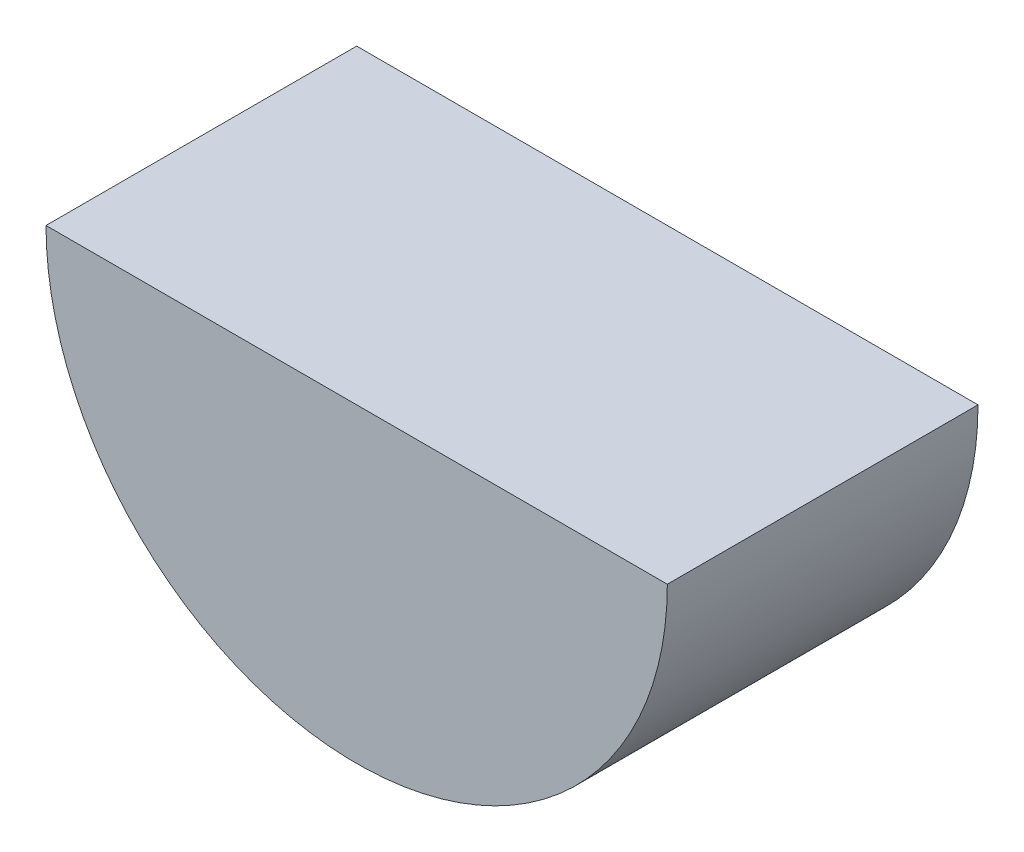
ISO-10303-21;
HEADER;
FILE_DESCRIPTION(('STEP AP214'),'2;1');
FILE_NAME('part.step','',(''),(''),'','','');
FILE_SCHEMA(('AUTOMOTIVE_DESIGN { 1 0 10303 214 1 1 1 1 }'));
ENDSEC;
DATA;
#1=APPLICATION_CONTEXT('core data for automotive mechanical design processes');
#2=APPLICATION_PROTOCOL_DEFINITION('international standard','automotive_design',2000,#1);
#3=PRODUCT_CONTEXT('',#1,'mechanical');
#4=PRODUCT('Part','Part','',(#3));
#5=PRODUCT_RELATED_PRODUCT_CATEGORY('part','',(#4));
#6=PRODUCT_DEFINITION_FORMATION('','',#4);
#7=PRODUCT_DEFINITION_CONTEXT('part definition',#1,'design');
#8=PRODUCT_DEFINITION('design','',#6,#7);
#9=PRODUCT_DEFINITION_SHAPE('','',#8);
#10=(LENGTH_UNIT() NAMED_UNIT(*) SI_UNIT(.MILLI.,.METRE.));
#11=(NAMED_UNIT(*) PLANE_ANGLE_UNIT() SI_UNIT($,.RADIAN.));
#12=(NAMED_UNIT(*) SI_UNIT($,.STERADIAN.) SOLID_ANGLE_UNIT());
#13=UNCERTAINTY_MEASURE_WITH_UNIT(LENGTH_MEASURE(1.E-05),#10,'distance_accuracy_value','');
#14=(GEOMETRIC_REPRESENTATION_CONTEXT(3) GLOBAL_UNCERTAINTY_ASSIGNED_CONTEXT((#13)) GLOBAL_UNIT_ASSIGNED_CONTEXT((#10,
#11,#12)) REPRESENTATION_CONTEXT('',''));
#15=CARTESIAN_POINT('',(0.,0.,0.));
#16=DIRECTION('',(0.,0.,1.));
#17=DIRECTION('',(1.,0.,0.));
#18=AXIS2_PLACEMENT_3D('',#15,#16,#17);
#19=CARTESIAN_POINT('',(0.,0.,7.5));
#20=DIRECTION('',(0.,0.,-1.));
#21=DIRECTION('',(-1.,0.,0.));
#22=AXIS2_PLACEMENT_3D('',#19,#20,#21);
#23=CYLINDRICAL_SURFACE('',#22,15.);
#24=CARTESIAN_POINT('',(0.,0.,-7.5));
#25=DIRECTION('',(0.,0.,1.));
#26=DIRECTION('',(1.,0.,0.));
#27=AXIS2_PLACEMENT_3D('',#24,#25,#26);
#28=CIRCLE('',#27,15.);
#29=CARTESIAN_POINT('',(-15.,0.,-7.5));
#30=VERTEX_POINT('',#29);
#31=CARTESIAN_POINT('',(15.,0.,-7.5));
#32=VERTEX_POINT('',#31);
#33=EDGE_CURVE('E64',#30,#32,#28,.T.);
#34=ORIENTED_EDGE('',*,*,#33,.T.);
#35=DIRECTION('',(0.,0.,-1.));
#36=VECTOR('',#35,1.);
#37=CARTESIAN_POINT('',(15.,0.,7.5));
#38=LINE('',#37,#36);
#39=CARTESIAN_POINT('',(15.,0.,7.5));
#40=VERTEX_POINT('',#39);
#41=EDGE_CURVE('E11',#40,#32,#38,.T.);
#42=ORIENTED_EDGE('',*,*,#41,.F.);
#43=CARTESIAN_POINT('',(0.,0.,7.5));
#44=DIRECTION('',(0.,0.,1.));
#45=DIRECTION('',(1.,0.,0.));
#46=AXIS2_PLACEMENT_3D('',#43,#44,#45);
#47=CIRCLE('',#46,15.);
#48=CARTESIAN_POINT('',(-15.,0.,7.5));
#49=VERTEX_POINT('',#48);
#50=EDGE_CURVE('E63',#49,#40,#47,.T.);
#51=ORIENTED_EDGE('',*,*,#50,.F.);
#52=DIRECTION('',(0.,0.,-1.));
#53=VECTOR('',#52,1.);
#54=CARTESIAN_POINT('',(-15.,0.,7.5));
#55=LINE('',#54,#53);
#56=EDGE_CURVE('E41',#49,#30,#55,.T.);
#57=ORIENTED_EDGE('',*,*,#56,.T.);
#58=EDGE_LOOP('',(#34,#42,#51,#57));
#59=FACE_BOUND('',#58,.T.);
#60=ADVANCED_FACE('F33',(#59),#23,.T.);
#61=CARTESIAN_POINT('',(-15.,0.,7.5));
#62=DIRECTION('',(0.,-1.,0.));
#63=DIRECTION('',(0.,0.,-1.));
#64=AXIS2_PLACEMENT_3D('',#61,#62,#63);
#65=PLANE('',#64);
#66=DIRECTION('',(-1.,0.,0.));
#67=VECTOR('',#66,1.);
#68=CARTESIAN_POINT('',(-15.,0.,-7.5));
#69=LINE('',#68,#67);
#70=EDGE_CURVE('E56',#32,#30,#69,.T.);
#71=ORIENTED_EDGE('',*,*,#70,.T.);
#72=ORIENTED_EDGE('',*,*,#56,.F.);
#73=DIRECTION('',(-1.,0.,0.));
#74=VECTOR('',#73,1.);
#75=CARTESIAN_POINT('',(-15.,0.,7.5));
#76=LINE('',#75,#74);
#77=EDGE_CURVE('E48',#40,#49,#76,.T.);
#78=ORIENTED_EDGE('',*,*,#77,.F.);
#79=ORIENTED_EDGE('',*,*,#41,.T.);
#80=EDGE_LOOP('',(#71,#72,#78,#79));
#81=FACE_BOUND('',#80,.T.);
#82=ADVANCED_FACE('F59',(#81),#65,.F.);
#83=CARTESIAN_POINT('',(0.,0.,7.5));
#84=DIRECTION('',(0.,0.,1.));
#85=DIRECTION('',(1.,0.,0.));
#86=AXIS2_PLACEMENT_3D('',#83,#84,#85);
#87=PLANE('',#86);
#88=ORIENTED_EDGE('',*,*,#50,.T.);
#89=ORIENTED_EDGE('',*,*,#77,.T.);
#90=EDGE_LOOP('',(#88,#89));
#91=FACE_BOUND('',#90,.T.);
#92=ADVANCED_FACE('F71',(#91),#87,.T.);
#93=CARTESIAN_POINT('',(0.,0.,-7.5));
#94=DIRECTION('',(0.,0.,1.));
#95=DIRECTION('',(1.,0.,0.));
#96=AXIS2_PLACEMENT_3D('',#93,#94,#95);
#97=PLANE('',#96);
#98=ORIENTED_EDGE('',*,*,#33,.F.);
#99=ORIENTED_EDGE('',*,*,#70,.F.);
#100=EDGE_LOOP('',(#98,#99));
#101=FACE_BOUND('',#100,.T.);
#102=ADVANCED_FACE('F67',(#101),#97,.F.);
#103=CLOSED_SHELL('',(#60,#82,#92,#102));
#104=MANIFOLD_SOLID_BREP('B2',#103);
#105=ADVANCED_BREP_SHAPE_REPRESENTATION('',(#18,#104),#14);
#106=SHAPE_DEFINITION_REPRESENTATION(#9,#105);
ENDSEC;
END-ISO-10303-21;
